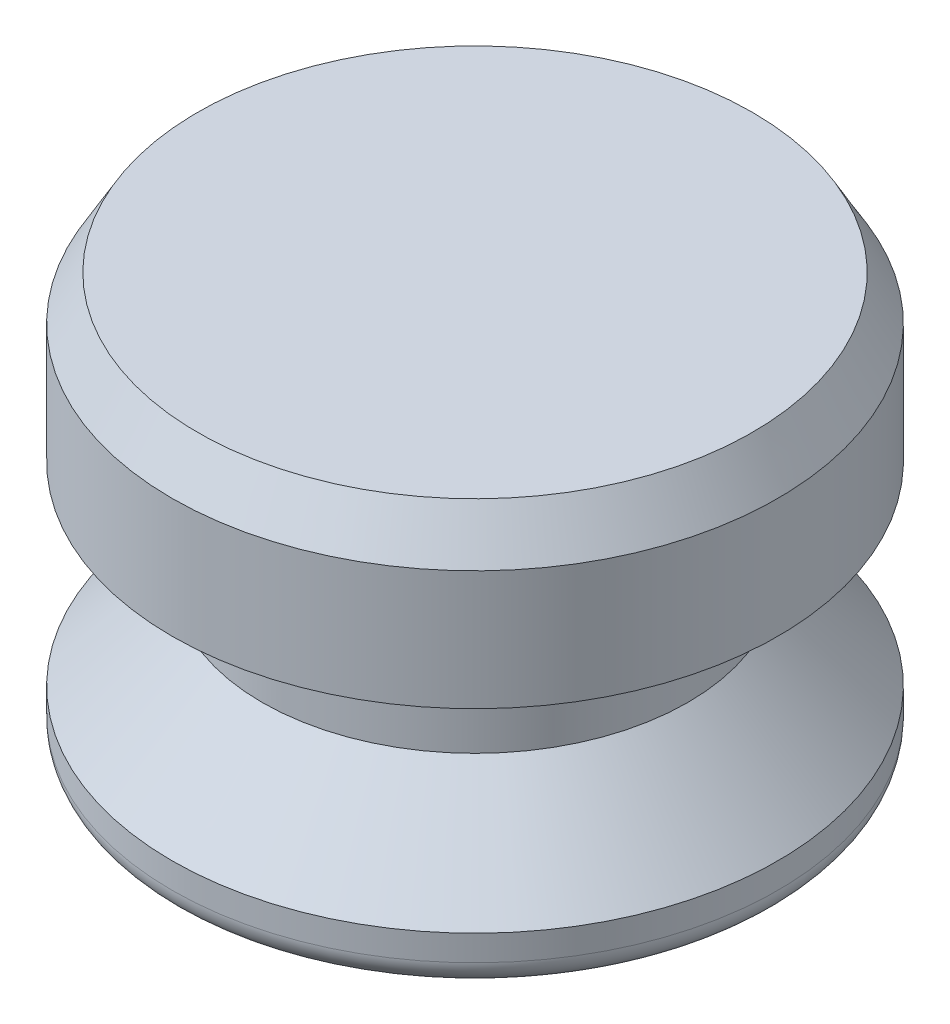
ISO-10303-21;
HEADER;
FILE_DESCRIPTION(('STEP AP214'),'2;1');
FILE_NAME('part.step','',(''),(''),'','','');
FILE_SCHEMA(('AUTOMOTIVE_DESIGN { 1 0 10303 214 1 1 1 1 }'));
ENDSEC;
DATA;
#1=APPLICATION_CONTEXT('core data for automotive mechanical design processes');
#2=APPLICATION_PROTOCOL_DEFINITION('international standard','automotive_design',2000,#1);
#3=PRODUCT_CONTEXT('',#1,'mechanical');
#4=PRODUCT('Part','Part','',(#3));
#5=PRODUCT_RELATED_PRODUCT_CATEGORY('part','',(#4));
#6=PRODUCT_DEFINITION_FORMATION('','',#4);
#7=PRODUCT_DEFINITION_CONTEXT('part definition',#1,'design');
#8=PRODUCT_DEFINITION('design','',#6,#7);
#9=PRODUCT_DEFINITION_SHAPE('','',#8);
#10=(LENGTH_UNIT() NAMED_UNIT(*) SI_UNIT(.MILLI.,.METRE.));
#11=(NAMED_UNIT(*) PLANE_ANGLE_UNIT() SI_UNIT($,.RADIAN.));
#12=(NAMED_UNIT(*) SI_UNIT($,.STERADIAN.) SOLID_ANGLE_UNIT());
#13=UNCERTAINTY_MEASURE_WITH_UNIT(LENGTH_MEASURE(1.E-05),#10,'distance_accuracy_value','');
#14=(GEOMETRIC_REPRESENTATION_CONTEXT(3) GLOBAL_UNCERTAINTY_ASSIGNED_CONTEXT((#13)) GLOBAL_UNIT_ASSIGNED_CONTEXT((#10,
#11,#12)) REPRESENTATION_CONTEXT('',''));
#15=CARTESIAN_POINT('',(0.,0.,0.));
#16=DIRECTION('',(0.,0.,1.));
#17=DIRECTION('',(1.,0.,0.));
#18=AXIS2_PLACEMENT_3D('',#15,#16,#17);
#19=CARTESIAN_POINT('',(0.,0.,0.));
#20=DIRECTION('',(0.,1.,0.));
#21=DIRECTION('',(0.,0.,1.));
#22=AXIS2_PLACEMENT_3D('',#19,#20,#21);
#23=PLANE('',#22);
#24=CARTESIAN_POINT('',(0.,0.,0.));
#25=DIRECTION('',(0.,1.,0.));
#26=DIRECTION('',(0.,0.,1.));
#27=AXIS2_PLACEMENT_3D('',#24,#25,#26);
#28=CIRCLE('',#27,8.60425);
#29=CARTESIAN_POINT('',(0.,0.,8.60425));
#30=VERTEX_POINT('',#29);
#31=EDGE_CURVE('E46',#30,#30,#28,.F.);
#32=ORIENTED_EDGE('',*,*,#31,.T.);
#33=EDGE_LOOP('',(#32));
#34=FACE_BOUND('',#33,.T.);
#35=ADVANCED_FACE('F31',(#34),#23,.F.);
#36=CARTESIAN_POINT('',(0.,0.,0.));
#37=DIRECTION('',(0.,-1.,0.));
#38=DIRECTION('',(0.,0.,-1.));
#39=AXIS2_PLACEMENT_3D('',#36,#37,#38);
#40=CYLINDRICAL_SURFACE('',#39,9.398);
#41=CARTESIAN_POINT('',(0.,0.793749999999999,0.));
#42=DIRECTION('',(0.,1.,0.));
#43=DIRECTION('',(0.,0.,1.));
#44=AXIS2_PLACEMENT_3D('',#41,#42,#43);
#45=CIRCLE('',#44,9.398);
#46=CARTESIAN_POINT('',(0.,0.793749999999999,9.398));
#47=VERTEX_POINT('',#46);
#48=EDGE_CURVE('E42',#47,#47,#45,.T.);
#49=ORIENTED_EDGE('',*,*,#48,.T.);
#50=EDGE_LOOP('',(#49));
#51=FACE_BOUND('',#50,.T.);
#52=CARTESIAN_POINT('',(0.,1.5875,0.));
#53=DIRECTION('',(0.,-1.,0.));
#54=DIRECTION('',(0.,0.,-1.));
#55=AXIS2_PLACEMENT_3D('',#52,#53,#54);
#56=CIRCLE('',#55,9.398);
#57=CARTESIAN_POINT('',(0.,1.5875,-9.398));
#58=VERTEX_POINT('',#57);
#59=EDGE_CURVE('E51',#58,#58,#56,.T.);
#60=ORIENTED_EDGE('',*,*,#59,.T.);
#61=EDGE_LOOP('',(#60));
#62=FACE_BOUND('',#61,.T.);
#63=ADVANCED_FACE('F80',(#51,#62),#40,.T.);
#64=CARTESIAN_POINT('',(0.,4.445,0.));
#65=DIRECTION('',(0.,-1.,0.));
#66=DIRECTION('',(0.,0.,-1.));
#67=AXIS2_PLACEMENT_3D('',#64,#65,#66);
#68=CONICAL_SURFACE('',#67,6.604,0.774162681139486);
#69=ORIENTED_EDGE('',*,*,#59,.F.);
#70=EDGE_LOOP('',(#69));
#71=FACE_BOUND('',#70,.T.);
#72=CARTESIAN_POINT('',(0.,4.445,0.));
#73=DIRECTION('',(0.,-1.,0.));
#74=DIRECTION('',(0.,0.,-1.));
#75=AXIS2_PLACEMENT_3D('',#72,#73,#74);
#76=CIRCLE('',#75,6.604);
#77=CARTESIAN_POINT('',(0.,4.445,-6.604));
#78=VERTEX_POINT('',#77);
#79=EDGE_CURVE('E54',#78,#78,#76,.T.);
#80=ORIENTED_EDGE('',*,*,#79,.T.);
#81=EDGE_LOOP('',(#80));
#82=FACE_BOUND('',#81,.T.);
#83=ADVANCED_FACE('F86',(#71,#82),#68,.T.);
#84=CARTESIAN_POINT('',(0.,0.,0.));
#85=DIRECTION('',(0.,-1.,0.));
#86=DIRECTION('',(0.,0.,-1.));
#87=AXIS2_PLACEMENT_3D('',#84,#85,#86);
#88=CYLINDRICAL_SURFACE('',#87,6.604);
#89=ORIENTED_EDGE('',*,*,#79,.F.);
#90=EDGE_LOOP('',(#89));
#91=FACE_BOUND('',#90,.T.);
#92=CARTESIAN_POINT('',(0.,7.62,0.));
#93=DIRECTION('',(0.,-1.,0.));
#94=DIRECTION('',(0.,0.,-1.));
#95=AXIS2_PLACEMENT_3D('',#92,#93,#94);
#96=CIRCLE('',#95,6.604);
#97=CARTESIAN_POINT('',(0.,7.62,-6.604));
#98=VERTEX_POINT('',#97);
#99=EDGE_CURVE('E57',#98,#98,#96,.T.);
#100=ORIENTED_EDGE('',*,*,#99,.T.);
#101=EDGE_LOOP('',(#100));
#102=FACE_BOUND('',#101,.T.);
#103=ADVANCED_FACE('F76',(#91,#102),#88,.T.);
#104=CARTESIAN_POINT('',(-6.604,7.62,0.));
#105=DIRECTION('',(0.,1.,0.));
#106=DIRECTION('',(0.,0.,1.));
#107=AXIS2_PLACEMENT_3D('',#104,#105,#106);
#108=PLANE('',#107);
#109=ORIENTED_EDGE('',*,*,#99,.F.);
#110=EDGE_LOOP('',(#109));
#111=FACE_BOUND('',#110,.T.);
#112=CARTESIAN_POINT('',(0.,7.62,0.));
#113=DIRECTION('',(0.,-1.,0.));
#114=DIRECTION('',(0.,0.,-1.));
#115=AXIS2_PLACEMENT_3D('',#112,#113,#114);
#116=CIRCLE('',#115,9.398);
#117=CARTESIAN_POINT('',(0.,7.62,-9.398));
#118=VERTEX_POINT('',#117);
#119=EDGE_CURVE('E60',#118,#118,#116,.T.);
#120=ORIENTED_EDGE('',*,*,#119,.T.);
#121=EDGE_LOOP('',(#120));
#122=FACE_BOUND('',#121,.T.);
#123=ADVANCED_FACE('F64',(#111,#122),#108,.F.);
#124=CARTESIAN_POINT('',(0.,0.,0.));
#125=DIRECTION('',(0.,-1.,0.));
#126=DIRECTION('',(0.,0.,-1.));
#127=AXIS2_PLACEMENT_3D('',#124,#125,#126);
#128=CYLINDRICAL_SURFACE('',#127,9.398);
#129=CARTESIAN_POINT('',(0.,11.3251846714922,0.));
#130=DIRECTION('',(0.,-1.,0.));
#131=DIRECTION('',(0.,0.,-1.));
#132=AXIS2_PLACEMENT_3D('',#129,#130,#131);
#133=CIRCLE('',#132,9.398);
#134=CARTESIAN_POINT('',(0.,11.3251846714922,-9.398));
#135=VERTEX_POINT('',#134);
#136=EDGE_CURVE('E38',#135,#135,#133,.T.);
#137=ORIENTED_EDGE('',*,*,#136,.T.);
#138=EDGE_LOOP('',(#137));
#139=FACE_BOUND('',#138,.T.);
#140=ORIENTED_EDGE('',*,*,#119,.F.);
#141=EDGE_LOOP('',(#140));
#142=FACE_BOUND('',#141,.T.);
#143=ADVANCED_FACE('F66',(#139,#142),#128,.T.);
#144=CARTESIAN_POINT('',(-9.398,12.7,0.));
#145=DIRECTION('',(0.,-1.,0.));
#146=DIRECTION('',(0.,0.,-1.));
#147=AXIS2_PLACEMENT_3D('',#144,#145,#146);
#148=PLANE('',#147);
#149=CARTESIAN_POINT('',(0.,12.7,0.));
#150=DIRECTION('',(0.,-1.,0.));
#151=DIRECTION('',(0.,0.,-1.));
#152=AXIS2_PLACEMENT_3D('',#149,#150,#151);
#153=CIRCLE('',#152,8.60424999999999);
#154=CARTESIAN_POINT('',(0.,12.7,-8.60424999999999));
#155=VERTEX_POINT('',#154);
#156=EDGE_CURVE('E10',#155,#155,#153,.F.);
#157=ORIENTED_EDGE('',*,*,#156,.T.);
#158=EDGE_LOOP('',(#157));
#159=FACE_BOUND('',#158,.T.);
#160=ADVANCED_FACE('F68',(#159),#148,.F.);
#161=CARTESIAN_POINT('',(0.,0.793749999999999,0.));
#162=DIRECTION('',(0.,1.,0.));
#163=DIRECTION('',(0.,0.,1.));
#164=AXIS2_PLACEMENT_3D('',#161,#162,#163);
#165=TOROIDAL_SURFACE('',#164,8.60425,0.79375);
#166=ORIENTED_EDGE('',*,*,#48,.F.);
#167=EDGE_LOOP('',(#166));
#168=FACE_BOUND('',#167,.T.);
#169=ORIENTED_EDGE('',*,*,#31,.F.);
#170=EDGE_LOOP('',(#169));
#171=FACE_BOUND('',#170,.T.);
#172=ADVANCED_FACE('F74',(#168,#171),#165,.T.);
#173=CARTESIAN_POINT('',(0.,11.3251846714922,0.));
#174=DIRECTION('',(0.,-1.,0.));
#175=DIRECTION('',(0.,0.,-1.));
#176=AXIS2_PLACEMENT_3D('',#173,#174,#175);
#177=CONICAL_SURFACE('',#176,9.398,0.5235987755983);
#178=ORIENTED_EDGE('',*,*,#156,.F.);
#179=EDGE_LOOP('',(#178));
#180=FACE_BOUND('',#179,.T.);
#181=ORIENTED_EDGE('',*,*,#136,.F.);
#182=EDGE_LOOP('',(#181));
#183=FACE_BOUND('',#182,.T.);
#184=ADVANCED_FACE('F33',(#180,#183),#177,.T.);
#185=CLOSED_SHELL('',(#35,#63,#83,#103,#123,#143,#160,#172,#184));
#186=MANIFOLD_SOLID_BREP('B2',#185);
#187=ADVANCED_BREP_SHAPE_REPRESENTATION('',(#18,#186),#14);
#188=SHAPE_DEFINITION_REPRESENTATION(#9,#187);
ENDSEC;
END-ISO-10303-21;
